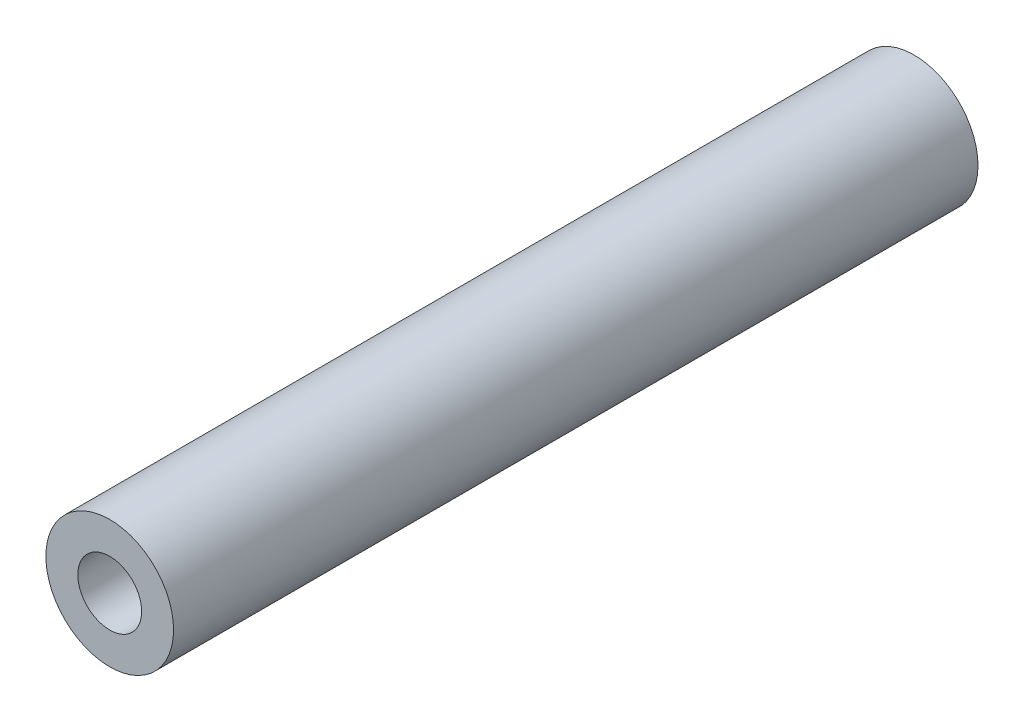
ISO-10303-21;
HEADER;
FILE_DESCRIPTION(('STEP AP214'),'2;1');
FILE_NAME('part.step','',(''),(''),'','','');
FILE_SCHEMA(('AUTOMOTIVE_DESIGN { 1 0 10303 214 1 1 1 1 }'));
ENDSEC;
DATA;
#1=APPLICATION_CONTEXT('core data for automotive mechanical design processes');
#2=APPLICATION_PROTOCOL_DEFINITION('international standard','automotive_design',2000,#1);
#3=PRODUCT_CONTEXT('',#1,'mechanical');
#4=PRODUCT('Part','Part','',(#3));
#5=PRODUCT_RELATED_PRODUCT_CATEGORY('part','',(#4));
#6=PRODUCT_DEFINITION_FORMATION('','',#4);
#7=PRODUCT_DEFINITION_CONTEXT('part definition',#1,'design');
#8=PRODUCT_DEFINITION('design','',#6,#7);
#9=PRODUCT_DEFINITION_SHAPE('','',#8);
#10=(LENGTH_UNIT() NAMED_UNIT(*) SI_UNIT(.MILLI.,.METRE.));
#11=(NAMED_UNIT(*) PLANE_ANGLE_UNIT() SI_UNIT($,.RADIAN.));
#12=(NAMED_UNIT(*) SI_UNIT($,.STERADIAN.) SOLID_ANGLE_UNIT());
#13=UNCERTAINTY_MEASURE_WITH_UNIT(LENGTH_MEASURE(1.E-05),#10,'distance_accuracy_value','');
#14=(GEOMETRIC_REPRESENTATION_CONTEXT(3) GLOBAL_UNCERTAINTY_ASSIGNED_CONTEXT((#13)) GLOBAL_UNIT_ASSIGNED_CONTEXT((#10,
#11,#12)) REPRESENTATION_CONTEXT('',''));
#15=CARTESIAN_POINT('',(0.,0.,0.));
#16=DIRECTION('',(0.,0.,1.));
#17=DIRECTION('',(1.,0.,0.));
#18=AXIS2_PLACEMENT_3D('',#15,#16,#17);
#19=CARTESIAN_POINT('',(-0.2166088223,-17.0652643177,170.08));
#20=DIRECTION('',(0.,0.,-1.));
#21=DIRECTION('',(-1.,0.,0.));
#22=AXIS2_PLACEMENT_3D('',#19,#20,#21);
#23=CYLINDRICAL_SURFACE('',#22,1.);
#24=CARTESIAN_POINT('',(-0.216608822300006,-17.0652643177,144.88));
#25=DIRECTION('',(0.,0.,-1.));
#26=DIRECTION('',(-1.,0.,0.));
#27=AXIS2_PLACEMENT_3D('',#24,#25,#26);
#28=CIRCLE('',#27,1.);
#29=CARTESIAN_POINT('',(-1.21660882230001,-17.0652643177,144.88));
#30=VERTEX_POINT('',#29);
#31=EDGE_CURVE('E17',#30,#30,#28,.T.);
#32=ORIENTED_EDGE('',*,*,#31,.T.);
#33=EDGE_LOOP('',(#32));
#34=FACE_BOUND('',#33,.T.);
#35=CARTESIAN_POINT('',(-0.2166088223,-17.0652643177,170.08));
#36=DIRECTION('',(0.,0.,-1.));
#37=DIRECTION('',(-1.,0.,0.));
#38=AXIS2_PLACEMENT_3D('',#35,#36,#37);
#39=CIRCLE('',#38,1.);
#40=CARTESIAN_POINT('',(-1.2166088223,-17.0652643177,170.08));
#41=VERTEX_POINT('',#40);
#42=EDGE_CURVE('E26',#41,#41,#39,.T.);
#43=ORIENTED_EDGE('',*,*,#42,.F.);
#44=EDGE_LOOP('',(#43));
#45=FACE_BOUND('',#44,.T.);
#46=ADVANCED_FACE('F14',(#34,#45),#23,.F.);
#47=CARTESIAN_POINT('',(-0.2166088223,-17.0652643177,144.88));
#48=DIRECTION('',(0.,0.,1.));
#49=DIRECTION('',(1.,0.,0.));
#50=AXIS2_PLACEMENT_3D('',#47,#48,#49);
#51=PLANE('',#50);
#52=CARTESIAN_POINT('',(-0.2166088223,-17.0652643177,144.88));
#53=DIRECTION('',(0.,0.,1.));
#54=DIRECTION('',(1.,0.,0.));
#55=AXIS2_PLACEMENT_3D('',#52,#53,#54);
#56=CIRCLE('',#55,2.);
#57=CARTESIAN_POINT('',(1.7833911777,-17.0652643177,144.88));
#58=VERTEX_POINT('',#57);
#59=EDGE_CURVE('E21',#58,#58,#56,.T.);
#60=ORIENTED_EDGE('',*,*,#59,.F.);
#61=EDGE_LOOP('',(#60));
#62=FACE_BOUND('',#61,.T.);
#63=ORIENTED_EDGE('',*,*,#31,.F.);
#64=EDGE_LOOP('',(#63));
#65=FACE_BOUND('',#64,.T.);
#66=ADVANCED_FACE('F36',(#62,#65),#51,.F.);
#67=CARTESIAN_POINT('',(-0.2166088223,-17.0652643177,170.08));
#68=DIRECTION('',(0.,0.,1.));
#69=DIRECTION('',(1.,0.,0.));
#70=AXIS2_PLACEMENT_3D('',#67,#68,#69);
#71=PLANE('',#70);
#72=ORIENTED_EDGE('',*,*,#42,.T.);
#73=EDGE_LOOP('',(#72));
#74=FACE_BOUND('',#73,.T.);
#75=CARTESIAN_POINT('',(-0.216608822299994,-17.0652643177,170.08));
#76=DIRECTION('',(0.,0.,1.));
#77=DIRECTION('',(1.,0.,0.));
#78=AXIS2_PLACEMENT_3D('',#75,#76,#77);
#79=CIRCLE('',#78,2.);
#80=CARTESIAN_POINT('',(1.78339117770001,-17.0652643177,170.08));
#81=VERTEX_POINT('',#80);
#82=EDGE_CURVE('E10',#81,#81,#79,.F.);
#83=ORIENTED_EDGE('',*,*,#82,.F.);
#84=EDGE_LOOP('',(#83));
#85=FACE_BOUND('',#84,.T.);
#86=ADVANCED_FACE('F38',(#74,#85),#71,.T.);
#87=CARTESIAN_POINT('',(-0.2166088223,-17.0652643177,144.88));
#88=DIRECTION('',(0.,0.,1.));
#89=DIRECTION('',(1.,0.,0.));
#90=AXIS2_PLACEMENT_3D('',#87,#88,#89);
#91=CYLINDRICAL_SURFACE('',#90,2.);
#92=ORIENTED_EDGE('',*,*,#82,.T.);
#93=EDGE_LOOP('',(#92));
#94=FACE_BOUND('',#93,.T.);
#95=ORIENTED_EDGE('',*,*,#59,.T.);
#96=EDGE_LOOP('',(#95));
#97=FACE_BOUND('',#96,.T.);
#98=ADVANCED_FACE('F45',(#94,#97),#91,.T.);
#99=CLOSED_SHELL('',(#46,#66,#86,#98));
#100=MANIFOLD_SOLID_BREP('B1',#99);
#101=ADVANCED_BREP_SHAPE_REPRESENTATION('',(#18,#100),#14);
#102=SHAPE_DEFINITION_REPRESENTATION(#9,#101);
ENDSEC;
END-ISO-10303-21;
